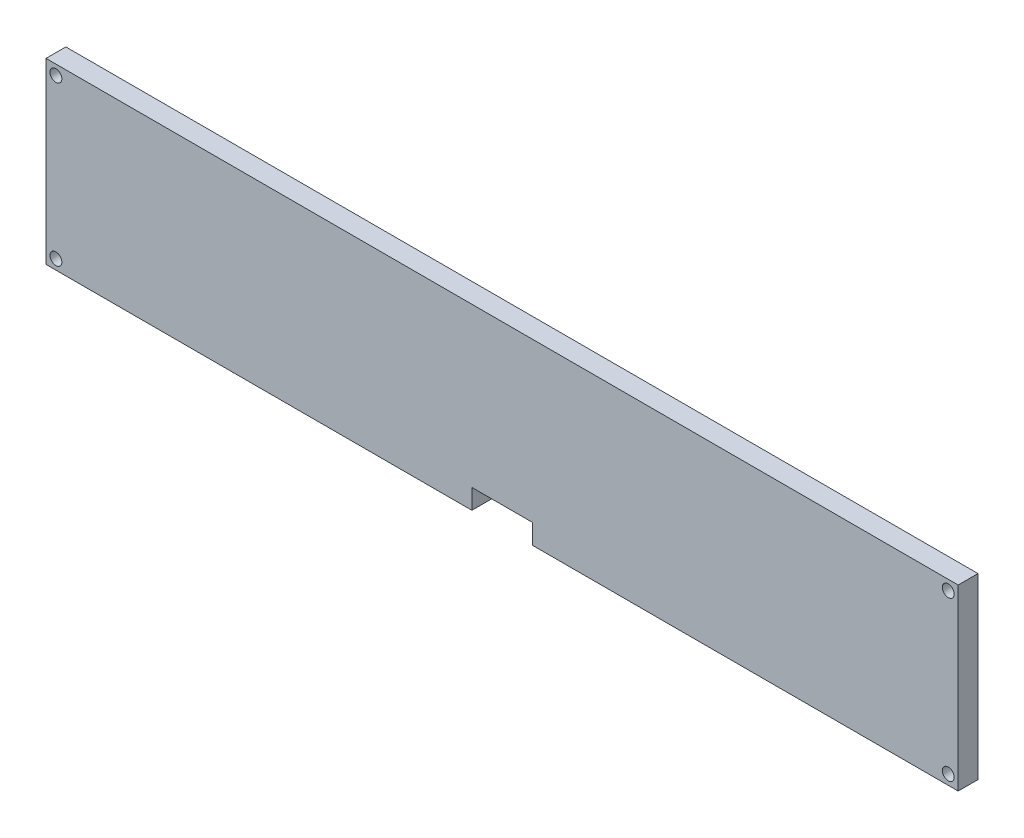
ISO-10303-21;
HEADER;
FILE_DESCRIPTION(('STEP AP214'),'2;1');
FILE_NAME('part.step','',(''),(''),'','','');
FILE_SCHEMA(('AUTOMOTIVE_DESIGN { 1 0 10303 214 1 1 1 1 }'));
ENDSEC;
DATA;
#1=APPLICATION_CONTEXT('core data for automotive mechanical design processes');
#2=APPLICATION_PROTOCOL_DEFINITION('international standard','automotive_design',2000,#1);
#3=PRODUCT_CONTEXT('',#1,'mechanical');
#4=PRODUCT('Part','Part','',(#3));
#5=PRODUCT_RELATED_PRODUCT_CATEGORY('part','',(#4));
#6=PRODUCT_DEFINITION_FORMATION('','',#4);
#7=PRODUCT_DEFINITION_CONTEXT('part definition',#1,'design');
#8=PRODUCT_DEFINITION('design','',#6,#7);
#9=PRODUCT_DEFINITION_SHAPE('','',#8);
#10=(LENGTH_UNIT() NAMED_UNIT(*) SI_UNIT(.MILLI.,.METRE.));
#11=(NAMED_UNIT(*) PLANE_ANGLE_UNIT() SI_UNIT($,.RADIAN.));
#12=(NAMED_UNIT(*) SI_UNIT($,.STERADIAN.) SOLID_ANGLE_UNIT());
#13=UNCERTAINTY_MEASURE_WITH_UNIT(LENGTH_MEASURE(1.E-05),#10,'distance_accuracy_value','');
#14=(GEOMETRIC_REPRESENTATION_CONTEXT(3) GLOBAL_UNCERTAINTY_ASSIGNED_CONTEXT((#13)) GLOBAL_UNIT_ASSIGNED_CONTEXT((#10,
#11,#12)) REPRESENTATION_CONTEXT('',''));
#15=CARTESIAN_POINT('',(0.,0.,0.));
#16=DIRECTION('',(0.,0.,1.));
#17=DIRECTION('',(1.,0.,0.));
#18=AXIS2_PLACEMENT_3D('',#15,#16,#17);
#19=CARTESIAN_POINT('',(0.,0.,5.));
#20=DIRECTION('',(0.,1.,0.));
#21=DIRECTION('',(0.,0.,1.));
#22=AXIS2_PLACEMENT_3D('',#19,#20,#21);
#23=PLANE('',#22);
#24=DIRECTION('',(1.,0.,0.));
#25=VECTOR('',#24,1.);
#26=CARTESIAN_POINT('',(0.,0.,0.));
#27=LINE('',#26,#25);
#28=CARTESIAN_POINT('',(0.,0.,0.));
#29=VERTEX_POINT('',#28);
#30=CARTESIAN_POINT('',(107.38,0.,0.));
#31=VERTEX_POINT('',#30);
#32=EDGE_CURVE('E174',#29,#31,#27,.T.);
#33=ORIENTED_EDGE('',*,*,#32,.T.);
#34=DIRECTION('',(0.,0.,1.));
#35=VECTOR('',#34,1.);
#36=CARTESIAN_POINT('',(107.38,0.,5.));
#37=LINE('',#36,#35);
#38=CARTESIAN_POINT('',(107.38,0.,5.));
#39=VERTEX_POINT('',#38);
#40=EDGE_CURVE('E137',#31,#39,#37,.T.);
#41=ORIENTED_EDGE('',*,*,#40,.T.);
#42=DIRECTION('',(1.,0.,0.));
#43=VECTOR('',#42,1.);
#44=CARTESIAN_POINT('',(0.,0.,5.));
#45=LINE('',#44,#43);
#46=CARTESIAN_POINT('',(0.,0.,5.));
#47=VERTEX_POINT('',#46);
#48=EDGE_CURVE('E85',#47,#39,#45,.T.);
#49=ORIENTED_EDGE('',*,*,#48,.F.);
#50=DIRECTION('',(0.,0.,-1.));
#51=VECTOR('',#50,1.);
#52=CARTESIAN_POINT('',(0.,0.,5.));
#53=LINE('',#52,#51);
#54=EDGE_CURVE('E41',#47,#29,#53,.T.);
#55=ORIENTED_EDGE('',*,*,#54,.T.);
#56=EDGE_LOOP('',(#33,#41,#49,#55));
#57=FACE_BOUND('',#56,.T.);
#58=ADVANCED_FACE('F33',(#57),#23,.F.);
#59=CARTESIAN_POINT('',(0.,0.,5.));
#60=DIRECTION('',(1.,0.,0.));
#61=DIRECTION('',(0.,0.,-1.));
#62=AXIS2_PLACEMENT_3D('',#59,#60,#61);
#63=PLANE('',#62);
#64=DIRECTION('',(0.,-1.,0.));
#65=VECTOR('',#64,1.);
#66=CARTESIAN_POINT('',(0.,0.,0.));
#67=LINE('',#66,#65);
#68=CARTESIAN_POINT('',(0.,45.,0.));
#69=VERTEX_POINT('',#68);
#70=EDGE_CURVE('E163',#69,#29,#67,.T.);
#71=ORIENTED_EDGE('',*,*,#70,.T.);
#72=ORIENTED_EDGE('',*,*,#54,.F.);
#73=DIRECTION('',(0.,-1.,0.));
#74=VECTOR('',#73,1.);
#75=CARTESIAN_POINT('',(0.,0.,5.));
#76=LINE('',#75,#74);
#77=CARTESIAN_POINT('',(0.,45.,5.));
#78=VERTEX_POINT('',#77);
#79=EDGE_CURVE('E164',#78,#47,#76,.T.);
#80=ORIENTED_EDGE('',*,*,#79,.F.);
#81=DIRECTION('',(0.,0.,-1.));
#82=VECTOR('',#81,1.);
#83=CARTESIAN_POINT('',(0.,45.,5.));
#84=LINE('',#83,#82);
#85=EDGE_CURVE('E171',#78,#69,#84,.T.);
#86=ORIENTED_EDGE('',*,*,#85,.T.);
#87=EDGE_LOOP('',(#71,#72,#80,#86));
#88=FACE_BOUND('',#87,.T.);
#89=ADVANCED_FACE('F35',(#88),#63,.F.);
#90=CARTESIAN_POINT('',(122.62,0.,5.));
#91=VERTEX_POINT('',#90);
#92=CARTESIAN_POINT('',(230.,0.,5.));
#93=VERTEX_POINT('',#92);
#94=EDGE_CURVE('E166',#91,#93,#45,.T.);
#95=ORIENTED_EDGE('',*,*,#94,.F.);
#96=DIRECTION('',(0.,0.,-1.));
#97=VECTOR('',#96,1.);
#98=CARTESIAN_POINT('',(122.62,0.,5.));
#99=LINE('',#98,#97);
#100=CARTESIAN_POINT('',(122.62,0.,0.));
#101=VERTEX_POINT('',#100);
#102=EDGE_CURVE('E134',#91,#101,#99,.T.);
#103=ORIENTED_EDGE('',*,*,#102,.T.);
#104=CARTESIAN_POINT('',(230.,0.,0.));
#105=VERTEX_POINT('',#104);
#106=EDGE_CURVE('E127',#101,#105,#27,.T.);
#107=ORIENTED_EDGE('',*,*,#106,.T.);
#108=DIRECTION('',(0.,0.,-1.));
#109=VECTOR('',#108,1.);
#110=CARTESIAN_POINT('',(230.,0.,5.));
#111=LINE('',#110,#109);
#112=EDGE_CURVE('E183',#93,#105,#111,.T.);
#113=ORIENTED_EDGE('',*,*,#112,.F.);
#114=EDGE_LOOP('',(#95,#103,#107,#113));
#115=FACE_BOUND('',#114,.T.);
#116=ADVANCED_FACE('F198',(#115),#23,.F.);
#117=CARTESIAN_POINT('',(230.,0.,5.));
#118=DIRECTION('',(-1.,0.,0.));
#119=DIRECTION('',(0.,0.,1.));
#120=AXIS2_PLACEMENT_3D('',#117,#118,#119);
#121=PLANE('',#120);
#122=DIRECTION('',(0.,1.,0.));
#123=VECTOR('',#122,1.);
#124=CARTESIAN_POINT('',(230.,0.,0.));
#125=LINE('',#124,#123);
#126=CARTESIAN_POINT('',(230.,45.,0.));
#127=VERTEX_POINT('',#126);
#128=EDGE_CURVE('E177',#105,#127,#125,.T.);
#129=ORIENTED_EDGE('',*,*,#128,.T.);
#130=DIRECTION('',(0.,0.,-1.));
#131=VECTOR('',#130,1.);
#132=CARTESIAN_POINT('',(230.,45.,5.));
#133=LINE('',#132,#131);
#134=CARTESIAN_POINT('',(230.,45.,5.));
#135=VERTEX_POINT('',#134);
#136=EDGE_CURVE('E181',#135,#127,#133,.T.);
#137=ORIENTED_EDGE('',*,*,#136,.F.);
#138=DIRECTION('',(0.,1.,0.));
#139=VECTOR('',#138,1.);
#140=CARTESIAN_POINT('',(230.,0.,5.));
#141=LINE('',#140,#139);
#142=EDGE_CURVE('E168',#93,#135,#141,.T.);
#143=ORIENTED_EDGE('',*,*,#142,.F.);
#144=ORIENTED_EDGE('',*,*,#112,.T.);
#145=EDGE_LOOP('',(#129,#137,#143,#144));
#146=FACE_BOUND('',#145,.T.);
#147=ADVANCED_FACE('F202',(#146),#121,.F.);
#148=CARTESIAN_POINT('',(0.,45.,5.));
#149=DIRECTION('',(0.,-1.,0.));
#150=DIRECTION('',(0.,0.,-1.));
#151=AXIS2_PLACEMENT_3D('',#148,#149,#150);
#152=PLANE('',#151);
#153=DIRECTION('',(-1.,0.,0.));
#154=VECTOR('',#153,1.);
#155=CARTESIAN_POINT('',(0.,45.,0.));
#156=LINE('',#155,#154);
#157=EDGE_CURVE('E77',#127,#69,#156,.T.);
#158=ORIENTED_EDGE('',*,*,#157,.T.);
#159=ORIENTED_EDGE('',*,*,#85,.F.);
#160=DIRECTION('',(-1.,0.,0.));
#161=VECTOR('',#160,1.);
#162=CARTESIAN_POINT('',(0.,45.,5.));
#163=LINE('',#162,#161);
#164=EDGE_CURVE('E56',#135,#78,#163,.T.);
#165=ORIENTED_EDGE('',*,*,#164,.F.);
#166=ORIENTED_EDGE('',*,*,#136,.T.);
#167=EDGE_LOOP('',(#158,#159,#165,#166));
#168=FACE_BOUND('',#167,.T.);
#169=ADVANCED_FACE('F203',(#168),#152,.F.);
#170=CARTESIAN_POINT('',(0.,0.,5.));
#171=DIRECTION('',(0.,0.,-1.));
#172=DIRECTION('',(-1.,0.,0.));
#173=AXIS2_PLACEMENT_3D('',#170,#171,#172);
#174=PLANE('',#173);
#175=ORIENTED_EDGE('',*,*,#48,.T.);
#176=DIRECTION('',(0.,-1.,0.));
#177=VECTOR('',#176,1.);
#178=CARTESIAN_POINT('',(107.38,-5.00000000000002,5.));
#179=LINE('',#178,#177);
#180=CARTESIAN_POINT('',(107.38,4.99999999999998,5.));
#181=VERTEX_POINT('',#180);
#182=EDGE_CURVE('E135',#181,#39,#179,.T.);
#183=ORIENTED_EDGE('',*,*,#182,.F.);
#184=DIRECTION('',(-1.,0.,0.));
#185=VECTOR('',#184,1.);
#186=CARTESIAN_POINT('',(122.62,4.99999999999998,5.));
#187=LINE('',#186,#185);
#188=CARTESIAN_POINT('',(122.62,4.99999999999998,5.));
#189=VERTEX_POINT('',#188);
#190=EDGE_CURVE('E132',#189,#181,#187,.T.);
#191=ORIENTED_EDGE('',*,*,#190,.F.);
#192=DIRECTION('',(0.,1.,0.));
#193=VECTOR('',#192,1.);
#194=CARTESIAN_POINT('',(122.62,-5.00000000000002,5.));
#195=LINE('',#194,#193);
#196=EDGE_CURVE('E114',#91,#189,#195,.T.);
#197=ORIENTED_EDGE('',*,*,#196,.F.);
#198=ORIENTED_EDGE('',*,*,#94,.T.);
#199=ORIENTED_EDGE('',*,*,#142,.T.);
#200=ORIENTED_EDGE('',*,*,#164,.T.);
#201=ORIENTED_EDGE('',*,*,#79,.T.);
#202=EDGE_LOOP('',(#175,#183,#191,#197,#198,#199,#200,#201));
#203=FACE_BOUND('',#202,.T.);
#204=CARTESIAN_POINT('',(2.49999999999997,42.4999999999996,5.));
#205=DIRECTION('',(0.,0.,-1.));
#206=DIRECTION('',(-1.,0.,0.));
#207=AXIS2_PLACEMENT_3D('',#204,#205,#206);
#208=CIRCLE('',#207,1.5);
#209=CARTESIAN_POINT('',(0.999999999999975,42.4999999999996,5.));
#210=VERTEX_POINT('',#209);
#211=EDGE_CURVE('E160',#210,#210,#208,.T.);
#212=ORIENTED_EDGE('',*,*,#211,.T.);
#213=EDGE_LOOP('',(#212));
#214=FACE_BOUND('',#213,.T.);
#215=CARTESIAN_POINT('',(2.50000000000014,2.4999999999997,5.));
#216=DIRECTION('',(0.,0.,-1.));
#217=DIRECTION('',(-1.,0.,0.));
#218=AXIS2_PLACEMENT_3D('',#215,#216,#217);
#219=CIRCLE('',#218,1.5);
#220=CARTESIAN_POINT('',(1.00000000000015,2.4999999999997,5.));
#221=VERTEX_POINT('',#220);
#222=EDGE_CURVE('E157',#221,#221,#219,.T.);
#223=ORIENTED_EDGE('',*,*,#222,.T.);
#224=EDGE_LOOP('',(#223));
#225=FACE_BOUND('',#224,.T.);
#226=CARTESIAN_POINT('',(227.5,2.50000000000011,5.));
#227=DIRECTION('',(0.,0.,-1.));
#228=DIRECTION('',(-1.,0.,0.));
#229=AXIS2_PLACEMENT_3D('',#226,#227,#228);
#230=CIRCLE('',#229,1.5);
#231=CARTESIAN_POINT('',(226.,2.50000000000011,5.));
#232=VERTEX_POINT('',#231);
#233=EDGE_CURVE('E154',#232,#232,#230,.T.);
#234=ORIENTED_EDGE('',*,*,#233,.T.);
#235=EDGE_LOOP('',(#234));
#236=FACE_BOUND('',#235,.T.);
#237=CARTESIAN_POINT('',(227.5,42.5,5.));
#238=DIRECTION('',(0.,0.,-1.));
#239=DIRECTION('',(-1.,0.,0.));
#240=AXIS2_PLACEMENT_3D('',#237,#238,#239);
#241=CIRCLE('',#240,1.5);
#242=CARTESIAN_POINT('',(226.,42.5,5.));
#243=VERTEX_POINT('',#242);
#244=EDGE_CURVE('E151',#243,#243,#241,.T.);
#245=ORIENTED_EDGE('',*,*,#244,.T.);
#246=EDGE_LOOP('',(#245));
#247=FACE_BOUND('',#246,.T.);
#248=ADVANCED_FACE('F192',(#203,#214,#225,#236,#247),#174,.F.);
#249=CARTESIAN_POINT('',(0.,0.,0.));
#250=DIRECTION('',(0.,0.,-1.));
#251=DIRECTION('',(-1.,0.,0.));
#252=AXIS2_PLACEMENT_3D('',#249,#250,#251);
#253=PLANE('',#252);
#254=DIRECTION('',(0.,1.,0.));
#255=VECTOR('',#254,1.);
#256=CARTESIAN_POINT('',(107.38,0.,0.));
#257=LINE('',#256,#255);
#258=CARTESIAN_POINT('',(107.38,4.99999999999998,0.));
#259=VERTEX_POINT('',#258);
#260=EDGE_CURVE('E11',#31,#259,#257,.T.);
#261=ORIENTED_EDGE('',*,*,#260,.F.);
#262=ORIENTED_EDGE('',*,*,#32,.F.);
#263=ORIENTED_EDGE('',*,*,#70,.F.);
#264=ORIENTED_EDGE('',*,*,#157,.F.);
#265=ORIENTED_EDGE('',*,*,#128,.F.);
#266=ORIENTED_EDGE('',*,*,#106,.F.);
#267=DIRECTION('',(0.,-1.,0.));
#268=VECTOR('',#267,1.);
#269=CARTESIAN_POINT('',(122.62,-5.00000000000002,0.));
#270=LINE('',#269,#268);
#271=CARTESIAN_POINT('',(122.62,4.99999999999998,0.));
#272=VERTEX_POINT('',#271);
#273=EDGE_CURVE('E111',#272,#101,#270,.T.);
#274=ORIENTED_EDGE('',*,*,#273,.F.);
#275=DIRECTION('',(1.,0.,0.));
#276=VECTOR('',#275,1.);
#277=CARTESIAN_POINT('',(122.62,4.99999999999998,0.));
#278=LINE('',#277,#276);
#279=EDGE_CURVE('E118',#259,#272,#278,.T.);
#280=ORIENTED_EDGE('',*,*,#279,.F.);
#281=EDGE_LOOP('',(#261,#262,#263,#264,#265,#266,#274,#280));
#282=FACE_BOUND('',#281,.T.);
#283=CARTESIAN_POINT('',(2.49999999999997,42.4999999999996,0.));
#284=DIRECTION('',(0.,0.,-1.));
#285=DIRECTION('',(1.,0.,0.));
#286=AXIS2_PLACEMENT_3D('',#283,#284,#285);
#287=CIRCLE('',#286,1.5);
#288=CARTESIAN_POINT('',(3.99999999999997,42.4999999999996,0.));
#289=VERTEX_POINT('',#288);
#290=EDGE_CURVE('E139',#289,#289,#287,.T.);
#291=ORIENTED_EDGE('',*,*,#290,.F.);
#292=EDGE_LOOP('',(#291));
#293=FACE_BOUND('',#292,.T.);
#294=CARTESIAN_POINT('',(2.50000000000014,2.4999999999997,0.));
#295=DIRECTION('',(0.,0.,-1.));
#296=DIRECTION('',(-1.,0.,0.));
#297=AXIS2_PLACEMENT_3D('',#294,#295,#296);
#298=CIRCLE('',#297,1.5);
#299=CARTESIAN_POINT('',(1.00000000000015,2.4999999999997,0.));
#300=VERTEX_POINT('',#299);
#301=EDGE_CURVE('E144',#300,#300,#298,.T.);
#302=ORIENTED_EDGE('',*,*,#301,.F.);
#303=EDGE_LOOP('',(#302));
#304=FACE_BOUND('',#303,.T.);
#305=CARTESIAN_POINT('',(227.5,2.50000000000011,0.));
#306=DIRECTION('',(0.,0.,-1.));
#307=DIRECTION('',(1.,0.,0.));
#308=AXIS2_PLACEMENT_3D('',#305,#306,#307);
#309=CIRCLE('',#308,1.5);
#310=CARTESIAN_POINT('',(229.,2.50000000000011,0.));
#311=VERTEX_POINT('',#310);
#312=EDGE_CURVE('E140',#311,#311,#309,.T.);
#313=ORIENTED_EDGE('',*,*,#312,.F.);
#314=EDGE_LOOP('',(#313));
#315=FACE_BOUND('',#314,.T.);
#316=CARTESIAN_POINT('',(227.5,42.5,0.));
#317=DIRECTION('',(0.,0.,-1.));
#318=DIRECTION('',(-1.,0.,0.));
#319=AXIS2_PLACEMENT_3D('',#316,#317,#318);
#320=CIRCLE('',#319,1.5);
#321=CARTESIAN_POINT('',(226.,42.5,0.));
#322=VERTEX_POINT('',#321);
#323=EDGE_CURVE('E143',#322,#322,#320,.T.);
#324=ORIENTED_EDGE('',*,*,#323,.F.);
#325=EDGE_LOOP('',(#324));
#326=FACE_BOUND('',#325,.T.);
#327=ADVANCED_FACE('F124',(#282,#293,#304,#315,#326),#253,.T.);
#328=CARTESIAN_POINT('',(227.5,42.5,10.));
#329=DIRECTION('',(0.,0.,-1.));
#330=DIRECTION('',(-1.,0.,0.));
#331=AXIS2_PLACEMENT_3D('',#328,#329,#330);
#332=CYLINDRICAL_SURFACE('',#331,1.5);
#333=ORIENTED_EDGE('',*,*,#323,.T.);
#334=EDGE_LOOP('',(#333));
#335=FACE_BOUND('',#334,.T.);
#336=ORIENTED_EDGE('',*,*,#244,.F.);
#337=EDGE_LOOP('',(#336));
#338=FACE_BOUND('',#337,.T.);
#339=ADVANCED_FACE('F231',(#335,#338),#332,.F.);
#340=CARTESIAN_POINT('',(227.5,2.50000000000011,10.));
#341=DIRECTION('',(0.,0.,-1.));
#342=DIRECTION('',(-1.,0.,0.));
#343=AXIS2_PLACEMENT_3D('',#340,#341,#342);
#344=CYLINDRICAL_SURFACE('',#343,1.5);
#345=ORIENTED_EDGE('',*,*,#312,.T.);
#346=EDGE_LOOP('',(#345));
#347=FACE_BOUND('',#346,.T.);
#348=ORIENTED_EDGE('',*,*,#233,.F.);
#349=EDGE_LOOP('',(#348));
#350=FACE_BOUND('',#349,.T.);
#351=ADVANCED_FACE('F261',(#347,#350),#344,.F.);
#352=CARTESIAN_POINT('',(2.50000000000014,2.4999999999997,10.));
#353=DIRECTION('',(0.,0.,-1.));
#354=DIRECTION('',(-1.,0.,0.));
#355=AXIS2_PLACEMENT_3D('',#352,#353,#354);
#356=CYLINDRICAL_SURFACE('',#355,1.5);
#357=ORIENTED_EDGE('',*,*,#301,.T.);
#358=EDGE_LOOP('',(#357));
#359=FACE_BOUND('',#358,.T.);
#360=ORIENTED_EDGE('',*,*,#222,.F.);
#361=EDGE_LOOP('',(#360));
#362=FACE_BOUND('',#361,.T.);
#363=ADVANCED_FACE('F264',(#359,#362),#356,.F.);
#364=CARTESIAN_POINT('',(2.49999999999997,42.4999999999996,10.));
#365=DIRECTION('',(0.,0.,-1.));
#366=DIRECTION('',(-1.,0.,0.));
#367=AXIS2_PLACEMENT_3D('',#364,#365,#366);
#368=CYLINDRICAL_SURFACE('',#367,1.5);
#369=ORIENTED_EDGE('',*,*,#290,.T.);
#370=EDGE_LOOP('',(#369));
#371=FACE_BOUND('',#370,.T.);
#372=ORIENTED_EDGE('',*,*,#211,.F.);
#373=EDGE_LOOP('',(#372));
#374=FACE_BOUND('',#373,.T.);
#375=ADVANCED_FACE('F239',(#371,#374),#368,.F.);
#376=CARTESIAN_POINT('',(107.38,-5.00000000000002,23.2279346059832));
#377=DIRECTION('',(-1.,0.,0.));
#378=DIRECTION('',(0.,0.,1.));
#379=AXIS2_PLACEMENT_3D('',#376,#377,#378);
#380=PLANE('',#379);
#381=ORIENTED_EDGE('',*,*,#260,.T.);
#382=DIRECTION('',(0.,0.,-1.));
#383=VECTOR('',#382,1.);
#384=CARTESIAN_POINT('',(107.38,4.99999999999998,23.2279346059832));
#385=LINE('',#384,#383);
#386=EDGE_CURVE('E48',#181,#259,#385,.T.);
#387=ORIENTED_EDGE('',*,*,#386,.F.);
#388=ORIENTED_EDGE('',*,*,#182,.T.);
#389=ORIENTED_EDGE('',*,*,#40,.F.);
#390=EDGE_LOOP('',(#381,#387,#388,#389));
#391=FACE_BOUND('',#390,.T.);
#392=ADVANCED_FACE('F190',(#391),#380,.F.);
#393=CARTESIAN_POINT('',(122.62,-5.00000000000002,23.2279346059832));
#394=DIRECTION('',(1.,0.,0.));
#395=DIRECTION('',(0.,0.,-1.));
#396=AXIS2_PLACEMENT_3D('',#393,#394,#395);
#397=PLANE('',#396);
#398=ORIENTED_EDGE('',*,*,#196,.T.);
#399=DIRECTION('',(0.,0.,-1.));
#400=VECTOR('',#399,1.);
#401=CARTESIAN_POINT('',(122.62,4.99999999999998,23.2279346059832));
#402=LINE('',#401,#400);
#403=EDGE_CURVE('E108',#189,#272,#402,.T.);
#404=ORIENTED_EDGE('',*,*,#403,.T.);
#405=ORIENTED_EDGE('',*,*,#273,.T.);
#406=ORIENTED_EDGE('',*,*,#102,.F.);
#407=EDGE_LOOP('',(#398,#404,#405,#406));
#408=FACE_BOUND('',#407,.T.);
#409=ADVANCED_FACE('F109',(#408),#397,.F.);
#410=CARTESIAN_POINT('',(122.62,4.99999999999998,23.2279346059832));
#411=DIRECTION('',(0.,1.,0.));
#412=DIRECTION('',(0.,0.,1.));
#413=AXIS2_PLACEMENT_3D('',#410,#411,#412);
#414=PLANE('',#413);
#415=ORIENTED_EDGE('',*,*,#190,.T.);
#416=ORIENTED_EDGE('',*,*,#386,.T.);
#417=ORIENTED_EDGE('',*,*,#279,.T.);
#418=ORIENTED_EDGE('',*,*,#403,.F.);
#419=EDGE_LOOP('',(#415,#416,#417,#418));
#420=FACE_BOUND('',#419,.T.);
#421=ADVANCED_FACE('F119',(#420),#414,.F.);
#422=CLOSED_SHELL('',(#58,#89,#116,#147,#169,#248,#327,#339,#351,#363,#375,#392,#409,#421));
#423=MANIFOLD_SOLID_BREP('B2',#422);
#424=ADVANCED_BREP_SHAPE_REPRESENTATION('',(#18,#423),#14);
#425=SHAPE_DEFINITION_REPRESENTATION(#9,#424);
ENDSEC;
END-ISO-10303-21;
